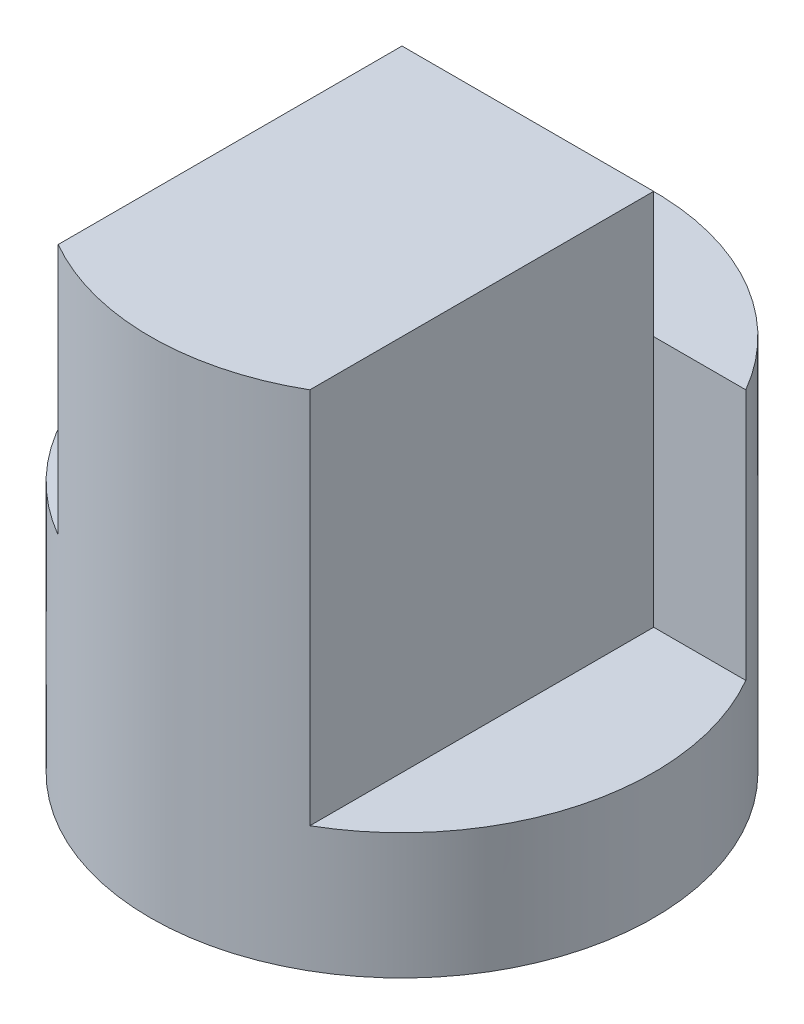
ISO-10303-21;
HEADER;
FILE_DESCRIPTION(('STEP AP214'),'2;1');
FILE_NAME('part.step','',(''),(''),'','','');
FILE_SCHEMA(('AUTOMOTIVE_DESIGN { 1 0 10303 214 1 1 1 1 }'));
ENDSEC;
DATA;
#1=APPLICATION_CONTEXT('core data for automotive mechanical design processes');
#2=APPLICATION_PROTOCOL_DEFINITION('international standard','automotive_design',2000,#1);
#3=PRODUCT_CONTEXT('',#1,'mechanical');
#4=PRODUCT('Part','Part','',(#3));
#5=PRODUCT_RELATED_PRODUCT_CATEGORY('part','',(#4));
#6=PRODUCT_DEFINITION_FORMATION('','',#4);
#7=PRODUCT_DEFINITION_CONTEXT('part definition',#1,'design');
#8=PRODUCT_DEFINITION('design','',#6,#7);
#9=PRODUCT_DEFINITION_SHAPE('','',#8);
#10=(LENGTH_UNIT() NAMED_UNIT(*) SI_UNIT(.MILLI.,.METRE.));
#11=(NAMED_UNIT(*) PLANE_ANGLE_UNIT() SI_UNIT($,.RADIAN.));
#12=(NAMED_UNIT(*) SI_UNIT($,.STERADIAN.) SOLID_ANGLE_UNIT());
#13=UNCERTAINTY_MEASURE_WITH_UNIT(LENGTH_MEASURE(1.E-05),#10,'distance_accuracy_value','');
#14=(GEOMETRIC_REPRESENTATION_CONTEXT(3) GLOBAL_UNCERTAINTY_ASSIGNED_CONTEXT((#13)) GLOBAL_UNIT_ASSIGNED_CONTEXT((#10,
#11,#12)) REPRESENTATION_CONTEXT('',''));
#15=CARTESIAN_POINT('',(0.,0.,0.));
#16=DIRECTION('',(0.,0.,1.));
#17=DIRECTION('',(1.,0.,0.));
#18=AXIS2_PLACEMENT_3D('',#15,#16,#17);
#19=CARTESIAN_POINT('',(0.,4.,0.));
#20=DIRECTION('',(0.,-1.,0.));
#21=DIRECTION('',(0.,0.,-1.));
#22=AXIS2_PLACEMENT_3D('',#19,#20,#21);
#23=CYLINDRICAL_SURFACE('',#22,2.);
#24=CARTESIAN_POINT('',(0.,0.,0.));
#25=DIRECTION('',(0.,1.,0.));
#26=DIRECTION('',(0.,0.,1.));
#27=AXIS2_PLACEMENT_3D('',#24,#25,#26);
#28=CIRCLE('',#27,2.);
#29=CARTESIAN_POINT('',(0.,0.,2.));
#30=VERTEX_POINT('',#29);
#31=EDGE_CURVE('E126',#30,#30,#28,.T.);
#32=ORIENTED_EDGE('',*,*,#31,.T.);
#33=EDGE_LOOP('',(#32));
#34=FACE_BOUND('',#33,.T.);
#35=DIRECTION('',(0.,-1.,0.));
#36=VECTOR('',#35,1.);
#37=CARTESIAN_POINT('',(-1.73205080756888,4.,-1.));
#38=LINE('',#37,#36);
#39=CARTESIAN_POINT('',(-1.73205080756888,3.,-1.));
#40=VERTEX_POINT('',#39);
#41=CARTESIAN_POINT('',(-1.73205080756888,2.,-1.));
#42=VERTEX_POINT('',#41);
#43=EDGE_CURVE('E102',#40,#42,#38,.T.);
#44=ORIENTED_EDGE('',*,*,#43,.F.);
#45=CARTESIAN_POINT('',(0.,3.,0.));
#46=DIRECTION('',(0.,1.,0.));
#47=DIRECTION('',(0.,0.,-1.));
#48=AXIS2_PLACEMENT_3D('',#45,#46,#47);
#49=CIRCLE('',#48,2.);
#50=CARTESIAN_POINT('',(1.73205080756888,3.,-1.));
#51=VERTEX_POINT('',#50);
#52=EDGE_CURVE('E88',#51,#40,#49,.T.);
#53=ORIENTED_EDGE('',*,*,#52,.F.);
#54=DIRECTION('',(0.,-1.,0.));
#55=VECTOR('',#54,1.);
#56=CARTESIAN_POINT('',(1.73205080756888,4.,-1.));
#57=LINE('',#56,#55);
#58=CARTESIAN_POINT('',(1.73205080756888,1.,-1.));
#59=VERTEX_POINT('',#58);
#60=EDGE_CURVE('E114',#59,#51,#57,.F.);
#61=ORIENTED_EDGE('',*,*,#60,.F.);
#62=CARTESIAN_POINT('',(0.,1.,0.));
#63=DIRECTION('',(0.,1.,0.));
#64=DIRECTION('',(0.,0.,1.));
#65=AXIS2_PLACEMENT_3D('',#62,#63,#64);
#66=CIRCLE('',#65,2.);
#67=CARTESIAN_POINT('',(1.,1.,1.73205080756888));
#68=VERTEX_POINT('',#67);
#69=EDGE_CURVE('E40',#68,#59,#66,.T.);
#70=ORIENTED_EDGE('',*,*,#69,.F.);
#71=DIRECTION('',(0.,-1.,0.));
#72=VECTOR('',#71,1.);
#73=CARTESIAN_POINT('',(1.,4.,1.73205080756888));
#74=LINE('',#73,#72);
#75=CARTESIAN_POINT('',(1.,4.,1.73205080756888));
#76=VERTEX_POINT('',#75);
#77=EDGE_CURVE('E124',#76,#68,#74,.T.);
#78=ORIENTED_EDGE('',*,*,#77,.F.);
#79=CARTESIAN_POINT('',(0.,4.,0.));
#80=DIRECTION('',(0.,1.,0.));
#81=DIRECTION('',(0.,0.,1.));
#82=AXIS2_PLACEMENT_3D('',#79,#80,#81);
#83=CIRCLE('',#82,2.);
#84=CARTESIAN_POINT('',(-1.,4.,1.73205080756888));
#85=VERTEX_POINT('',#84);
#86=EDGE_CURVE('E127',#85,#76,#83,.T.);
#87=ORIENTED_EDGE('',*,*,#86,.F.);
#88=DIRECTION('',(0.,-1.,0.));
#89=VECTOR('',#88,1.);
#90=CARTESIAN_POINT('',(-1.,4.,1.73205080756888));
#91=LINE('',#90,#89);
#92=CARTESIAN_POINT('',(-1.,2.,1.73205080756888));
#93=VERTEX_POINT('',#92);
#94=EDGE_CURVE('E111',#93,#85,#91,.F.);
#95=ORIENTED_EDGE('',*,*,#94,.F.);
#96=CARTESIAN_POINT('',(0.,2.,0.));
#97=DIRECTION('',(0.,1.,0.));
#98=DIRECTION('',(0.,0.,1.));
#99=AXIS2_PLACEMENT_3D('',#96,#97,#98);
#100=CIRCLE('',#99,2.);
#101=EDGE_CURVE('E110',#42,#93,#100,.T.);
#102=ORIENTED_EDGE('',*,*,#101,.F.);
#103=EDGE_LOOP('',(#44,#53,#61,#70,#78,#87,#95,#102));
#104=FACE_BOUND('',#103,.T.);
#105=ADVANCED_FACE('F33',(#34,#104),#23,.T.);
#106=CARTESIAN_POINT('',(0.,4.,0.));
#107=DIRECTION('',(0.,1.,0.));
#108=DIRECTION('',(0.,0.,1.));
#109=AXIS2_PLACEMENT_3D('',#106,#107,#108);
#110=PLANE('',#109);
#111=DIRECTION('',(1.,0.,0.));
#112=VECTOR('',#111,1.);
#113=CARTESIAN_POINT('',(-1.73205080756888,4.,-1.));
#114=LINE('',#113,#112);
#115=CARTESIAN_POINT('',(-1.,4.,-1.));
#116=VERTEX_POINT('',#115);
#117=CARTESIAN_POINT('',(1.,4.,-1.));
#118=VERTEX_POINT('',#117);
#119=EDGE_CURVE('E96',#116,#118,#114,.T.);
#120=ORIENTED_EDGE('',*,*,#119,.F.);
#121=DIRECTION('',(0.,0.,1.));
#122=VECTOR('',#121,1.);
#123=CARTESIAN_POINT('',(-1.,4.,0.));
#124=LINE('',#123,#122);
#125=EDGE_CURVE('E130',#116,#85,#124,.T.);
#126=ORIENTED_EDGE('',*,*,#125,.T.);
#127=ORIENTED_EDGE('',*,*,#86,.T.);
#128=DIRECTION('',(0.,0.,-1.));
#129=VECTOR('',#128,1.);
#130=CARTESIAN_POINT('',(1.,4.,0.));
#131=LINE('',#130,#129);
#132=EDGE_CURVE('E135',#76,#118,#131,.T.);
#133=ORIENTED_EDGE('',*,*,#132,.T.);
#134=EDGE_LOOP('',(#120,#126,#127,#133));
#135=FACE_BOUND('',#134,.T.);
#136=ADVANCED_FACE('F167',(#135),#110,.T.);
#137=CARTESIAN_POINT('',(0.,0.,0.));
#138=DIRECTION('',(0.,1.,0.));
#139=DIRECTION('',(0.,0.,1.));
#140=AXIS2_PLACEMENT_3D('',#137,#138,#139);
#141=PLANE('',#140);
#142=ORIENTED_EDGE('',*,*,#31,.F.);
#143=EDGE_LOOP('',(#142));
#144=FACE_BOUND('',#143,.T.);
#145=ADVANCED_FACE('F170',(#144),#141,.F.);
#146=CARTESIAN_POINT('',(-2.,2.,3.));
#147=DIRECTION('',(0.,1.,0.));
#148=DIRECTION('',(0.,0.,1.));
#149=AXIS2_PLACEMENT_3D('',#146,#147,#148);
#150=PLANE('',#149);
#151=ORIENTED_EDGE('',*,*,#101,.T.);
#152=DIRECTION('',(0.,0.,-1.));
#153=VECTOR('',#152,1.);
#154=CARTESIAN_POINT('',(-1.,2.,3.));
#155=LINE('',#154,#153);
#156=CARTESIAN_POINT('',(-1.,2.,-1.));
#157=VERTEX_POINT('',#156);
#158=EDGE_CURVE('E120',#93,#157,#155,.T.);
#159=ORIENTED_EDGE('',*,*,#158,.T.);
#160=DIRECTION('',(1.,0.,0.));
#161=VECTOR('',#160,1.);
#162=CARTESIAN_POINT('',(-2.,2.,-1.));
#163=LINE('',#162,#161);
#164=EDGE_CURVE('E152',#42,#157,#163,.T.);
#165=ORIENTED_EDGE('',*,*,#164,.F.);
#166=EDGE_LOOP('',(#151,#159,#165));
#167=FACE_BOUND('',#166,.T.);
#168=ADVANCED_FACE('F155',(#167),#150,.T.);
#169=CARTESIAN_POINT('',(-1.,4.,3.));
#170=DIRECTION('',(-1.,0.,0.));
#171=DIRECTION('',(0.,-1.,0.));
#172=AXIS2_PLACEMENT_3D('',#169,#170,#171);
#173=PLANE('',#172);
#174=ORIENTED_EDGE('',*,*,#94,.T.);
#175=ORIENTED_EDGE('',*,*,#125,.F.);
#176=DIRECTION('',(0.,1.,0.));
#177=VECTOR('',#176,1.);
#178=CARTESIAN_POINT('',(-1.,4.,-1.));
#179=LINE('',#178,#177);
#180=CARTESIAN_POINT('',(-1.,3.,-1.));
#181=VERTEX_POINT('',#180);
#182=EDGE_CURVE('E106',#181,#116,#179,.T.);
#183=ORIENTED_EDGE('',*,*,#182,.F.);
#184=DIRECTION('',(0.,1.,0.));
#185=VECTOR('',#184,1.);
#186=CARTESIAN_POINT('',(-1.,4.,-1.));
#187=LINE('',#186,#185);
#188=EDGE_CURVE('E105',#157,#181,#187,.T.);
#189=ORIENTED_EDGE('',*,*,#188,.F.);
#190=ORIENTED_EDGE('',*,*,#158,.F.);
#191=EDGE_LOOP('',(#174,#175,#183,#189,#190));
#192=FACE_BOUND('',#191,.T.);
#193=ADVANCED_FACE('F157',(#192),#173,.T.);
#194=CARTESIAN_POINT('',(0.,0.,-1.));
#195=DIRECTION('',(0.,0.,1.));
#196=DIRECTION('',(1.,0.,0.));
#197=AXIS2_PLACEMENT_3D('',#194,#195,#196);
#198=PLANE('',#197);
#199=DIRECTION('',(1.,0.,0.));
#200=VECTOR('',#199,1.);
#201=CARTESIAN_POINT('',(-1.73205080756888,3.,-1.));
#202=LINE('',#201,#200);
#203=EDGE_CURVE('E91',#40,#181,#202,.T.);
#204=ORIENTED_EDGE('',*,*,#203,.F.);
#205=ORIENTED_EDGE('',*,*,#43,.T.);
#206=ORIENTED_EDGE('',*,*,#164,.T.);
#207=ORIENTED_EDGE('',*,*,#188,.T.);
#208=EDGE_LOOP('',(#204,#205,#206,#207));
#209=FACE_BOUND('',#208,.T.);
#210=ADVANCED_FACE('F100',(#209),#198,.T.);
#211=CARTESIAN_POINT('',(1.,1.,3.));
#212=DIRECTION('',(0.,1.,0.));
#213=DIRECTION('',(0.,0.,1.));
#214=AXIS2_PLACEMENT_3D('',#211,#212,#213);
#215=PLANE('',#214);
#216=DIRECTION('',(0.,0.,-1.));
#217=VECTOR('',#216,1.);
#218=CARTESIAN_POINT('',(1.,1.,3.));
#219=LINE('',#218,#217);
#220=CARTESIAN_POINT('',(1.,1.,-1.));
#221=VERTEX_POINT('',#220);
#222=EDGE_CURVE('E112',#68,#221,#219,.T.);
#223=ORIENTED_EDGE('',*,*,#222,.F.);
#224=ORIENTED_EDGE('',*,*,#69,.T.);
#225=DIRECTION('',(1.,0.,0.));
#226=VECTOR('',#225,1.);
#227=CARTESIAN_POINT('',(1.,1.,-1.));
#228=LINE('',#227,#226);
#229=EDGE_CURVE('E117',#221,#59,#228,.T.);
#230=ORIENTED_EDGE('',*,*,#229,.F.);
#231=EDGE_LOOP('',(#223,#224,#230));
#232=FACE_BOUND('',#231,.T.);
#233=ADVANCED_FACE('F142',(#232),#215,.T.);
#234=CARTESIAN_POINT('',(1.,4.,3.));
#235=DIRECTION('',(1.,0.,0.));
#236=DIRECTION('',(0.,0.,-1.));
#237=AXIS2_PLACEMENT_3D('',#234,#235,#236);
#238=PLANE('',#237);
#239=ORIENTED_EDGE('',*,*,#77,.T.);
#240=ORIENTED_EDGE('',*,*,#222,.T.);
#241=DIRECTION('',(0.,-1.,0.));
#242=VECTOR('',#241,1.);
#243=CARTESIAN_POINT('',(1.,4.,-1.));
#244=LINE('',#243,#242);
#245=CARTESIAN_POINT('',(1.,3.,-1.));
#246=VERTEX_POINT('',#245);
#247=EDGE_CURVE('E146',#246,#221,#244,.T.);
#248=ORIENTED_EDGE('',*,*,#247,.F.);
#249=EDGE_CURVE('E147',#118,#246,#244,.T.);
#250=ORIENTED_EDGE('',*,*,#249,.F.);
#251=ORIENTED_EDGE('',*,*,#132,.F.);
#252=EDGE_LOOP('',(#239,#240,#248,#250,#251));
#253=FACE_BOUND('',#252,.T.);
#254=ADVANCED_FACE('F166',(#253),#238,.T.);
#255=CARTESIAN_POINT('',(0.,0.,-1.));
#256=DIRECTION('',(0.,0.,1.));
#257=DIRECTION('',(1.,0.,0.));
#258=AXIS2_PLACEMENT_3D('',#255,#256,#257);
#259=PLANE('',#258);
#260=DIRECTION('',(1.,0.,0.));
#261=VECTOR('',#260,1.);
#262=CARTESIAN_POINT('',(0.,3.,-1.));
#263=LINE('',#262,#261);
#264=EDGE_CURVE('E11',#246,#51,#263,.T.);
#265=ORIENTED_EDGE('',*,*,#264,.F.);
#266=ORIENTED_EDGE('',*,*,#247,.T.);
#267=ORIENTED_EDGE('',*,*,#229,.T.);
#268=ORIENTED_EDGE('',*,*,#60,.T.);
#269=EDGE_LOOP('',(#265,#266,#267,#268));
#270=FACE_BOUND('',#269,.T.);
#271=ADVANCED_FACE('F144',(#270),#259,.T.);
#272=CARTESIAN_POINT('',(-1.73205080756888,3.,-1.));
#273=DIRECTION('',(0.,0.,1.));
#274=DIRECTION('',(1.,0.,0.));
#275=AXIS2_PLACEMENT_3D('',#272,#273,#274);
#276=PLANE('',#275);
#277=ORIENTED_EDGE('',*,*,#182,.T.);
#278=ORIENTED_EDGE('',*,*,#119,.T.);
#279=ORIENTED_EDGE('',*,*,#249,.T.);
#280=EDGE_CURVE('E46',#181,#246,#202,.T.);
#281=ORIENTED_EDGE('',*,*,#280,.F.);
#282=EDGE_LOOP('',(#277,#278,#279,#281));
#283=FACE_BOUND('',#282,.T.);
#284=ADVANCED_FACE('F163',(#283),#276,.F.);
#285=CARTESIAN_POINT('',(0.,3.,0.));
#286=DIRECTION('',(0.,-1.,0.));
#287=DIRECTION('',(0.,0.,-1.));
#288=AXIS2_PLACEMENT_3D('',#285,#286,#287);
#289=PLANE('',#288);
#290=ORIENTED_EDGE('',*,*,#52,.T.);
#291=ORIENTED_EDGE('',*,*,#203,.T.);
#292=ORIENTED_EDGE('',*,*,#280,.T.);
#293=ORIENTED_EDGE('',*,*,#264,.T.);
#294=EDGE_LOOP('',(#290,#291,#292,#293));
#295=FACE_BOUND('',#294,.T.);
#296=ADVANCED_FACE('F90',(#295),#289,.F.);
#297=CLOSED_SHELL('',(#105,#136,#145,#168,#193,#210,#233,#254,#271,#284,#296));
#298=MANIFOLD_SOLID_BREP('B2',#297);
#299=ADVANCED_BREP_SHAPE_REPRESENTATION('',(#18,#298),#14);
#300=SHAPE_DEFINITION_REPRESENTATION(#9,#299);
ENDSEC;
END-ISO-10303-21;
